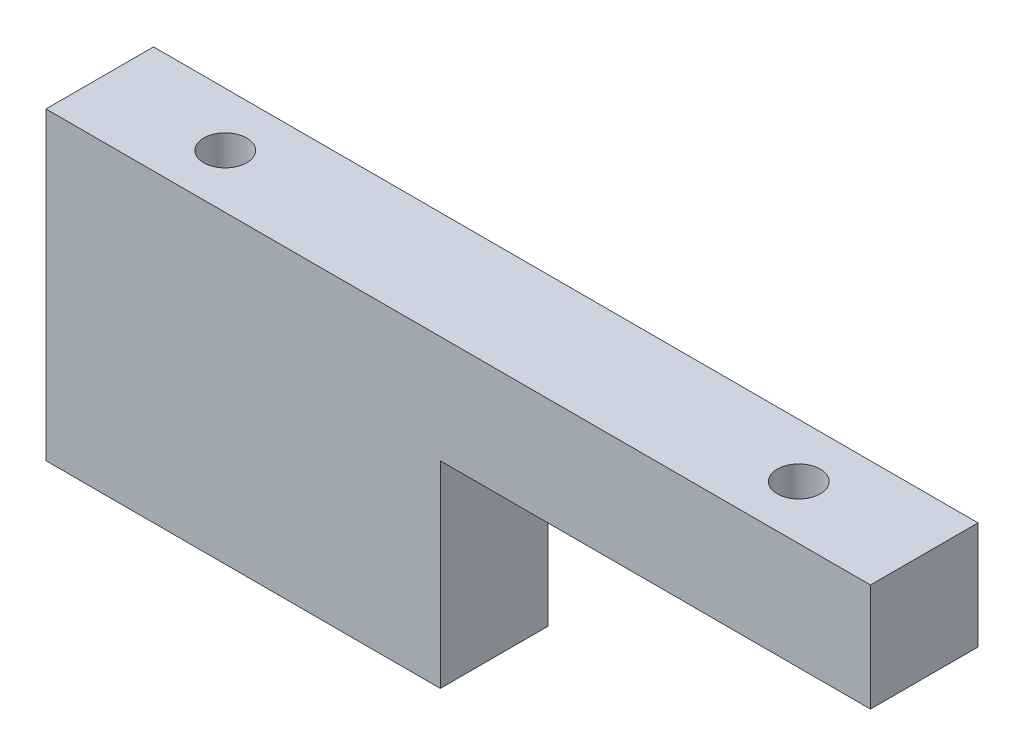
ISO-10303-21;
HEADER;
FILE_DESCRIPTION(('STEP AP214'),'2;1');
FILE_NAME('part.step','',(''),(''),'','','');
FILE_SCHEMA(('AUTOMOTIVE_DESIGN { 1 0 10303 214 1 1 1 1 }'));
ENDSEC;
DATA;
#1=APPLICATION_CONTEXT('core data for automotive mechanical design processes');
#2=APPLICATION_PROTOCOL_DEFINITION('international standard','automotive_design',2000,#1);
#3=PRODUCT_CONTEXT('',#1,'mechanical');
#4=PRODUCT('Part','Part','',(#3));
#5=PRODUCT_RELATED_PRODUCT_CATEGORY('part','',(#4));
#6=PRODUCT_DEFINITION_FORMATION('','',#4);
#7=PRODUCT_DEFINITION_CONTEXT('part definition',#1,'design');
#8=PRODUCT_DEFINITION('design','',#6,#7);
#9=PRODUCT_DEFINITION_SHAPE('','',#8);
#10=(LENGTH_UNIT() NAMED_UNIT(*) SI_UNIT(.MILLI.,.METRE.));
#11=(NAMED_UNIT(*) PLANE_ANGLE_UNIT() SI_UNIT($,.RADIAN.));
#12=(NAMED_UNIT(*) SI_UNIT($,.STERADIAN.) SOLID_ANGLE_UNIT());
#13=UNCERTAINTY_MEASURE_WITH_UNIT(LENGTH_MEASURE(1.E-05),#10,'distance_accuracy_value','');
#14=(GEOMETRIC_REPRESENTATION_CONTEXT(3) GLOBAL_UNCERTAINTY_ASSIGNED_CONTEXT((#13)) GLOBAL_UNIT_ASSIGNED_CONTEXT((#10,
#11,#12)) REPRESENTATION_CONTEXT('',''));
#15=CARTESIAN_POINT('',(0.,0.,0.));
#16=DIRECTION('',(0.,0.,1.));
#17=DIRECTION('',(1.,0.,0.));
#18=AXIS2_PLACEMENT_3D('',#15,#16,#17);
#19=CARTESIAN_POINT('',(57.5,42.5,7.5));
#20=DIRECTION('',(-1.,0.,0.));
#21=DIRECTION('',(0.,0.,1.));
#22=AXIS2_PLACEMENT_3D('',#19,#20,#21);
#23=PLANE('',#22);
#24=DIRECTION('',(0.,0.,-1.));
#25=VECTOR('',#24,1.);
#26=CARTESIAN_POINT('',(57.5,27.5,7.500012));
#27=LINE('',#26,#25);
#28=CARTESIAN_POINT('',(57.5,27.5,7.5));
#29=VERTEX_POINT('',#28);
#30=CARTESIAN_POINT('',(57.5,27.5,-7.5));
#31=VERTEX_POINT('',#30);
#32=EDGE_CURVE('E105',#29,#31,#27,.T.);
#33=ORIENTED_EDGE('',*,*,#32,.T.);
#34=DIRECTION('',(0.,-1.,0.));
#35=VECTOR('',#34,1.);
#36=CARTESIAN_POINT('',(57.5,42.5,-7.5));
#37=LINE('',#36,#35);
#38=CARTESIAN_POINT('',(57.5,42.5,-7.5));
#39=VERTEX_POINT('',#38);
#40=EDGE_CURVE('E11',#39,#31,#37,.T.);
#41=ORIENTED_EDGE('',*,*,#40,.F.);
#42=DIRECTION('',(0.,0.,-1.));
#43=VECTOR('',#42,1.);
#44=CARTESIAN_POINT('',(57.5,42.5,7.5));
#45=LINE('',#44,#43);
#46=CARTESIAN_POINT('',(57.5,42.5,7.5));
#47=VERTEX_POINT('',#46);
#48=EDGE_CURVE('E233',#47,#39,#45,.T.);
#49=ORIENTED_EDGE('',*,*,#48,.F.);
#50=DIRECTION('',(0.,-1.,0.));
#51=VECTOR('',#50,1.);
#52=CARTESIAN_POINT('',(57.5,42.5,7.5));
#53=LINE('',#52,#51);
#54=EDGE_CURVE('E117',#47,#29,#53,.T.);
#55=ORIENTED_EDGE('',*,*,#54,.T.);
#56=EDGE_LOOP('',(#33,#41,#49,#55));
#57=FACE_BOUND('',#56,.T.);
#58=ADVANCED_FACE('F40',(#57),#23,.F.);
#59=CARTESIAN_POINT('',(-57.5,42.5,-7.5));
#60=DIRECTION('',(0.,0.,1.));
#61=DIRECTION('',(1.,0.,0.));
#62=AXIS2_PLACEMENT_3D('',#59,#60,#61);
#63=PLANE('',#62);
#64=DIRECTION('',(1.,0.,0.));
#65=VECTOR('',#64,1.);
#66=CARTESIAN_POINT('',(57.5,27.5,-7.5));
#67=LINE('',#66,#65);
#68=CARTESIAN_POINT('',(-2.49999999999999,27.5,-7.5));
#69=VERTEX_POINT('',#68);
#70=EDGE_CURVE('E102',#69,#31,#67,.T.);
#71=ORIENTED_EDGE('',*,*,#70,.F.);
#72=DIRECTION('',(0.,1.,0.));
#73=VECTOR('',#72,1.);
#74=CARTESIAN_POINT('',(-2.49999999999999,0.,-7.5));
#75=LINE('',#74,#73);
#76=CARTESIAN_POINT('',(-2.49999999999999,0.,-7.5));
#77=VERTEX_POINT('',#76);
#78=EDGE_CURVE('E215',#77,#69,#75,.T.);
#79=ORIENTED_EDGE('',*,*,#78,.F.);
#80=DIRECTION('',(-1.,0.,0.));
#81=VECTOR('',#80,1.);
#82=CARTESIAN_POINT('',(-57.5,0.,-7.5));
#83=LINE('',#82,#81);
#84=CARTESIAN_POINT('',(-57.5,0.,-7.5));
#85=VERTEX_POINT('',#84);
#86=EDGE_CURVE('E227',#77,#85,#83,.T.);
#87=ORIENTED_EDGE('',*,*,#86,.T.);
#88=DIRECTION('',(0.,-1.,0.));
#89=VECTOR('',#88,1.);
#90=CARTESIAN_POINT('',(-57.5,42.5,-7.5));
#91=LINE('',#90,#89);
#92=CARTESIAN_POINT('',(-57.5,42.5,-7.5));
#93=VERTEX_POINT('',#92);
#94=EDGE_CURVE('E47',#93,#85,#91,.T.);
#95=ORIENTED_EDGE('',*,*,#94,.F.);
#96=DIRECTION('',(-1.,0.,0.));
#97=VECTOR('',#96,1.);
#98=CARTESIAN_POINT('',(-57.5,42.5,-7.5));
#99=LINE('',#98,#97);
#100=EDGE_CURVE('E86',#39,#93,#99,.T.);
#101=ORIENTED_EDGE('',*,*,#100,.F.);
#102=ORIENTED_EDGE('',*,*,#40,.T.);
#103=EDGE_LOOP('',(#71,#79,#87,#95,#101,#102));
#104=FACE_BOUND('',#103,.T.);
#105=ADVANCED_FACE('F120',(#104),#63,.F.);
#106=CARTESIAN_POINT('',(-57.5,42.5,7.5));
#107=DIRECTION('',(0.,0.,-1.));
#108=DIRECTION('',(-1.,0.,0.));
#109=AXIS2_PLACEMENT_3D('',#106,#107,#108);
#110=PLANE('',#109);
#111=DIRECTION('',(-1.,0.,0.));
#112=VECTOR('',#111,1.);
#113=CARTESIAN_POINT('',(-57.5,27.5,7.5));
#114=LINE('',#113,#112);
#115=CARTESIAN_POINT('',(-2.49999999999999,27.5,7.5));
#116=VERTEX_POINT('',#115);
#117=EDGE_CURVE('E118',#29,#116,#114,.T.);
#118=ORIENTED_EDGE('',*,*,#117,.F.);
#119=ORIENTED_EDGE('',*,*,#54,.F.);
#120=DIRECTION('',(1.,0.,0.));
#121=VECTOR('',#120,1.);
#122=CARTESIAN_POINT('',(-57.5,42.5,7.5));
#123=LINE('',#122,#121);
#124=CARTESIAN_POINT('',(-57.5,42.5,7.5));
#125=VERTEX_POINT('',#124);
#126=EDGE_CURVE('E63',#125,#47,#123,.T.);
#127=ORIENTED_EDGE('',*,*,#126,.F.);
#128=DIRECTION('',(0.,-1.,0.));
#129=VECTOR('',#128,1.);
#130=CARTESIAN_POINT('',(-57.5,42.5,7.5));
#131=LINE('',#130,#129);
#132=CARTESIAN_POINT('',(-57.5,0.,7.5));
#133=VERTEX_POINT('',#132);
#134=EDGE_CURVE('E245',#125,#133,#131,.T.);
#135=ORIENTED_EDGE('',*,*,#134,.T.);
#136=DIRECTION('',(1.,0.,0.));
#137=VECTOR('',#136,1.);
#138=CARTESIAN_POINT('',(-57.5,0.,7.5));
#139=LINE('',#138,#137);
#140=CARTESIAN_POINT('',(-2.49999999999999,0.,7.5));
#141=VERTEX_POINT('',#140);
#142=EDGE_CURVE('E235',#133,#141,#139,.T.);
#143=ORIENTED_EDGE('',*,*,#142,.T.);
#144=DIRECTION('',(0.,-1.,0.));
#145=VECTOR('',#144,1.);
#146=CARTESIAN_POINT('',(-2.49999999999999,42.5,7.5));
#147=LINE('',#146,#145);
#148=EDGE_CURVE('E54',#116,#141,#147,.T.);
#149=ORIENTED_EDGE('',*,*,#148,.F.);
#150=EDGE_LOOP('',(#118,#119,#127,#135,#143,#149));
#151=FACE_BOUND('',#150,.T.);
#152=ADVANCED_FACE('F122',(#151),#110,.F.);
#153=CARTESIAN_POINT('',(0.,0.,0.));
#154=DIRECTION('',(0.,-1.,0.));
#155=DIRECTION('',(0.,0.,-1.));
#156=AXIS2_PLACEMENT_3D('',#153,#154,#155);
#157=PLANE('',#156);
#158=CARTESIAN_POINT('',(-40.,0.,0.));
#159=DIRECTION('',(0.,1.,0.));
#160=DIRECTION('',(0.,0.,1.));
#161=AXIS2_PLACEMENT_3D('',#158,#159,#160);
#162=CIRCLE('',#161,3.);
#163=CARTESIAN_POINT('',(-40.,0.,3.));
#164=VERTEX_POINT('',#163);
#165=EDGE_CURVE('E224',#164,#164,#162,.T.);
#166=ORIENTED_EDGE('',*,*,#165,.T.);
#167=EDGE_LOOP('',(#166));
#168=FACE_BOUND('',#167,.T.);
#169=ORIENTED_EDGE('',*,*,#86,.F.);
#170=DIRECTION('',(0.,0.,-1.));
#171=VECTOR('',#170,1.);
#172=CARTESIAN_POINT('',(-2.49999999999999,0.,7.500012));
#173=LINE('',#172,#171);
#174=EDGE_CURVE('E110',#141,#77,#173,.T.);
#175=ORIENTED_EDGE('',*,*,#174,.F.);
#176=ORIENTED_EDGE('',*,*,#142,.F.);
#177=DIRECTION('',(0.,0.,1.));
#178=VECTOR('',#177,1.);
#179=CARTESIAN_POINT('',(-57.5,0.,7.5));
#180=LINE('',#179,#178);
#181=EDGE_CURVE('E79',#85,#133,#180,.T.);
#182=ORIENTED_EDGE('',*,*,#181,.F.);
#183=EDGE_LOOP('',(#169,#175,#176,#182));
#184=FACE_BOUND('',#183,.T.);
#185=ADVANCED_FACE('F127',(#168,#184),#157,.T.);
#186=CARTESIAN_POINT('',(40.,0.,0.));
#187=DIRECTION('',(0.,1.,0.));
#188=DIRECTION('',(0.,0.,1.));
#189=AXIS2_PLACEMENT_3D('',#186,#187,#188);
#190=CYLINDRICAL_SURFACE('',#189,3.);
#191=CARTESIAN_POINT('',(40.,42.5,0.));
#192=DIRECTION('',(0.,1.,0.));
#193=DIRECTION('',(0.,0.,1.));
#194=AXIS2_PLACEMENT_3D('',#191,#192,#193);
#195=CIRCLE('',#194,3.);
#196=CARTESIAN_POINT('',(40.,42.5,2.99999999999999));
#197=VERTEX_POINT('',#196);
#198=EDGE_CURVE('E223',#197,#197,#195,.T.);
#199=ORIENTED_EDGE('',*,*,#198,.T.);
#200=EDGE_LOOP('',(#199));
#201=FACE_BOUND('',#200,.T.);
#202=CARTESIAN_POINT('',(40.,27.5,0.));
#203=DIRECTION('',(0.,1.,0.));
#204=DIRECTION('',(-1.,0.,0.));
#205=AXIS2_PLACEMENT_3D('',#202,#203,#204);
#206=CIRCLE('',#205,3.);
#207=CARTESIAN_POINT('',(37.,27.5,0.));
#208=VERTEX_POINT('',#207);
#209=EDGE_CURVE('E111',#208,#208,#206,.T.);
#210=ORIENTED_EDGE('',*,*,#209,.F.);
#211=EDGE_LOOP('',(#210));
#212=FACE_BOUND('',#211,.T.);
#213=ADVANCED_FACE('F134',(#201,#212),#190,.F.);
#214=CARTESIAN_POINT('',(-57.5,42.5,7.5));
#215=DIRECTION('',(1.,0.,0.));
#216=DIRECTION('',(0.,0.,-1.));
#217=AXIS2_PLACEMENT_3D('',#214,#215,#216);
#218=PLANE('',#217);
#219=ORIENTED_EDGE('',*,*,#181,.T.);
#220=ORIENTED_EDGE('',*,*,#134,.F.);
#221=DIRECTION('',(0.,0.,1.));
#222=VECTOR('',#221,1.);
#223=CARTESIAN_POINT('',(-57.5,42.5,7.5));
#224=LINE('',#223,#222);
#225=EDGE_CURVE('E237',#93,#125,#224,.T.);
#226=ORIENTED_EDGE('',*,*,#225,.F.);
#227=ORIENTED_EDGE('',*,*,#94,.T.);
#228=EDGE_LOOP('',(#219,#220,#226,#227));
#229=FACE_BOUND('',#228,.T.);
#230=ADVANCED_FACE('F131',(#229),#218,.F.);
#231=CARTESIAN_POINT('',(0.,42.5,0.));
#232=DIRECTION('',(0.,-1.,0.));
#233=DIRECTION('',(0.,0.,-1.));
#234=AXIS2_PLACEMENT_3D('',#231,#232,#233);
#235=PLANE('',#234);
#236=CARTESIAN_POINT('',(-40.,42.5,0.));
#237=DIRECTION('',(0.,1.,0.));
#238=DIRECTION('',(0.,0.,1.));
#239=AXIS2_PLACEMENT_3D('',#236,#237,#238);
#240=CIRCLE('',#239,3.);
#241=CARTESIAN_POINT('',(-40.,42.5,3.));
#242=VERTEX_POINT('',#241);
#243=EDGE_CURVE('E228',#242,#242,#240,.T.);
#244=ORIENTED_EDGE('',*,*,#243,.F.);
#245=EDGE_LOOP('',(#244));
#246=FACE_BOUND('',#245,.T.);
#247=ORIENTED_EDGE('',*,*,#198,.F.);
#248=EDGE_LOOP('',(#247));
#249=FACE_BOUND('',#248,.T.);
#250=ORIENTED_EDGE('',*,*,#48,.T.);
#251=ORIENTED_EDGE('',*,*,#100,.T.);
#252=ORIENTED_EDGE('',*,*,#225,.T.);
#253=ORIENTED_EDGE('',*,*,#126,.T.);
#254=EDGE_LOOP('',(#250,#251,#252,#253));
#255=FACE_BOUND('',#254,.T.);
#256=ADVANCED_FACE('F133',(#246,#249,#255),#235,.F.);
#257=CARTESIAN_POINT('',(-40.,0.,0.));
#258=DIRECTION('',(0.,1.,0.));
#259=DIRECTION('',(0.,0.,1.));
#260=AXIS2_PLACEMENT_3D('',#257,#258,#259);
#261=CYLINDRICAL_SURFACE('',#260,3.);
#262=ORIENTED_EDGE('',*,*,#165,.F.);
#263=EDGE_LOOP('',(#262));
#264=FACE_BOUND('',#263,.T.);
#265=ORIENTED_EDGE('',*,*,#243,.T.);
#266=EDGE_LOOP('',(#265));
#267=FACE_BOUND('',#266,.T.);
#268=ADVANCED_FACE('F141',(#264,#267),#261,.F.);
#269=CARTESIAN_POINT('',(-2.49999999999999,0.,7.500012));
#270=DIRECTION('',(1.,0.,0.));
#271=DIRECTION('',(0.,0.,-1.));
#272=AXIS2_PLACEMENT_3D('',#269,#270,#271);
#273=PLANE('',#272);
#274=ORIENTED_EDGE('',*,*,#148,.T.);
#275=ORIENTED_EDGE('',*,*,#174,.T.);
#276=ORIENTED_EDGE('',*,*,#78,.T.);
#277=DIRECTION('',(0.,0.,-1.));
#278=VECTOR('',#277,1.);
#279=CARTESIAN_POINT('',(-2.49999999999999,27.5,7.500012));
#280=LINE('',#279,#278);
#281=EDGE_CURVE('E107',#116,#69,#280,.T.);
#282=ORIENTED_EDGE('',*,*,#281,.F.);
#283=EDGE_LOOP('',(#274,#275,#276,#282));
#284=FACE_BOUND('',#283,.T.);
#285=ADVANCED_FACE('F148',(#284),#273,.T.);
#286=CARTESIAN_POINT('',(57.5,27.5,7.500012));
#287=DIRECTION('',(0.,-1.,0.));
#288=DIRECTION('',(1.,0.,0.));
#289=AXIS2_PLACEMENT_3D('',#286,#287,#288);
#290=PLANE('',#289);
#291=ORIENTED_EDGE('',*,*,#209,.T.);
#292=EDGE_LOOP('',(#291));
#293=FACE_BOUND('',#292,.T.);
#294=ORIENTED_EDGE('',*,*,#117,.T.);
#295=ORIENTED_EDGE('',*,*,#281,.T.);
#296=ORIENTED_EDGE('',*,*,#70,.T.);
#297=ORIENTED_EDGE('',*,*,#32,.F.);
#298=EDGE_LOOP('',(#294,#295,#296,#297));
#299=FACE_BOUND('',#298,.T.);
#300=ADVANCED_FACE('F104',(#293,#299),#290,.T.);
#301=CLOSED_SHELL('',(#58,#105,#152,#185,#213,#230,#256,#268,#285,#300));
#302=MANIFOLD_SOLID_BREP('B2',#301);
#303=ADVANCED_BREP_SHAPE_REPRESENTATION('',(#18,#302),#14);
#304=SHAPE_DEFINITION_REPRESENTATION(#9,#303);
ENDSEC;
END-ISO-10303-21;
